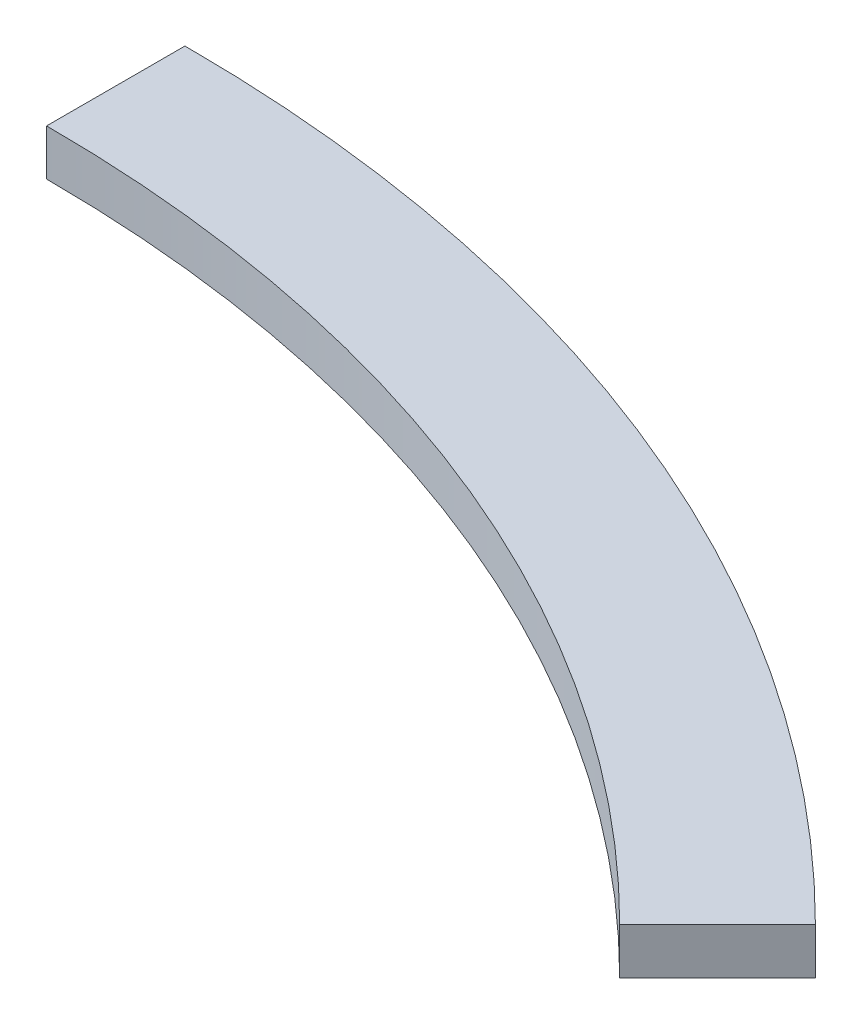
ISO-10303-21;
HEADER;
FILE_DESCRIPTION(('STEP AP214'),'2;1');
FILE_NAME('part.step','',(''),(''),'','','');
FILE_SCHEMA(('AUTOMOTIVE_DESIGN { 1 0 10303 214 1 1 1 1 }'));
ENDSEC;
DATA;
#1=APPLICATION_CONTEXT('core data for automotive mechanical design processes');
#2=APPLICATION_PROTOCOL_DEFINITION('international standard','automotive_design',2000,#1);
#3=PRODUCT_CONTEXT('',#1,'mechanical');
#4=PRODUCT('Part','Part','',(#3));
#5=PRODUCT_RELATED_PRODUCT_CATEGORY('part','',(#4));
#6=PRODUCT_DEFINITION_FORMATION('','',#4);
#7=PRODUCT_DEFINITION_CONTEXT('part definition',#1,'design');
#8=PRODUCT_DEFINITION('design','',#6,#7);
#9=PRODUCT_DEFINITION_SHAPE('','',#8);
#10=(LENGTH_UNIT() NAMED_UNIT(*) SI_UNIT(.MILLI.,.METRE.));
#11=(NAMED_UNIT(*) PLANE_ANGLE_UNIT() SI_UNIT($,.RADIAN.));
#12=(NAMED_UNIT(*) SI_UNIT($,.STERADIAN.) SOLID_ANGLE_UNIT());
#13=UNCERTAINTY_MEASURE_WITH_UNIT(LENGTH_MEASURE(1.E-05),#10,'distance_accuracy_value','');
#14=(GEOMETRIC_REPRESENTATION_CONTEXT(3) GLOBAL_UNCERTAINTY_ASSIGNED_CONTEXT((#13)) GLOBAL_UNIT_ASSIGNED_CONTEXT((#10,
#11,#12)) REPRESENTATION_CONTEXT('',''));
#15=CARTESIAN_POINT('',(0.,0.,0.));
#16=DIRECTION('',(0.,0.,1.));
#17=DIRECTION('',(1.,0.,0.));
#18=AXIS2_PLACEMENT_3D('',#15,#16,#17);
#19=CARTESIAN_POINT('',(0.,10.,0.));
#20=DIRECTION('',(0.,-1.,0.));
#21=DIRECTION('',(0.,0.,-1.));
#22=AXIS2_PLACEMENT_3D('',#19,#20,#21);
#23=CYLINDRICAL_SURFACE('',#22,330.);
#24=CARTESIAN_POINT('',(0.,0.,0.));
#25=DIRECTION('',(0.,1.,0.));
#26=DIRECTION('',(0.,0.,1.));
#27=AXIS2_PLACEMENT_3D('',#24,#25,#26);
#28=CIRCLE('',#27,330.);
#29=CARTESIAN_POINT('',(0.,0.,-330.));
#30=VERTEX_POINT('',#29);
#31=CARTESIAN_POINT('',(233.345237791561,0.,-233.34523779156));
#32=VERTEX_POINT('',#31);
#33=EDGE_CURVE('E97',#30,#32,#28,.F.);
#34=ORIENTED_EDGE('',*,*,#33,.F.);
#35=DIRECTION('',(0.,-1.,0.));
#36=VECTOR('',#35,1.);
#37=CARTESIAN_POINT('',(0.,10.,-330.));
#38=LINE('',#37,#36);
#39=CARTESIAN_POINT('',(0.,10.,-330.));
#40=VERTEX_POINT('',#39);
#41=EDGE_CURVE('E11',#40,#30,#38,.T.);
#42=ORIENTED_EDGE('',*,*,#41,.F.);
#43=CARTESIAN_POINT('',(0.,10.,0.));
#44=DIRECTION('',(0.,1.,0.));
#45=DIRECTION('',(0.,0.,1.));
#46=AXIS2_PLACEMENT_3D('',#43,#44,#45);
#47=CIRCLE('',#46,330.);
#48=CARTESIAN_POINT('',(233.345237791561,10.,-233.34523779156));
#49=VERTEX_POINT('',#48);
#50=EDGE_CURVE('E91',#40,#49,#47,.F.);
#51=ORIENTED_EDGE('',*,*,#50,.T.);
#52=DIRECTION('',(0.,-1.,0.));
#53=VECTOR('',#52,1.);
#54=CARTESIAN_POINT('',(233.345237791561,10.,-233.34523779156));
#55=LINE('',#54,#53);
#56=EDGE_CURVE('E72',#49,#32,#55,.T.);
#57=ORIENTED_EDGE('',*,*,#56,.T.);
#58=EDGE_LOOP('',(#34,#42,#51,#57));
#59=FACE_BOUND('',#58,.T.);
#60=ADVANCED_FACE('F34',(#59),#23,.T.);
#61=CARTESIAN_POINT('',(0.,10.,0.));
#62=DIRECTION('',(-1.,0.,0.));
#63=DIRECTION('',(0.,0.,1.));
#64=AXIS2_PLACEMENT_3D('',#61,#62,#63);
#65=PLANE('',#64);
#66=DIRECTION('',(0.,0.,-1.));
#67=VECTOR('',#66,1.);
#68=CARTESIAN_POINT('',(0.,0.,0.));
#69=LINE('',#68,#67);
#70=CARTESIAN_POINT('',(0.,0.,-300.));
#71=VERTEX_POINT('',#70);
#72=EDGE_CURVE('E85',#71,#30,#69,.T.);
#73=ORIENTED_EDGE('',*,*,#72,.F.);
#74=DIRECTION('',(0.,-1.,0.));
#75=VECTOR('',#74,1.);
#76=CARTESIAN_POINT('',(0.,10.,-300.));
#77=LINE('',#76,#75);
#78=CARTESIAN_POINT('',(0.,10.,-300.));
#79=VERTEX_POINT('',#78);
#80=EDGE_CURVE('E42',#79,#71,#77,.T.);
#81=ORIENTED_EDGE('',*,*,#80,.F.);
#82=DIRECTION('',(0.,0.,-1.));
#83=VECTOR('',#82,1.);
#84=CARTESIAN_POINT('',(0.,10.,0.));
#85=LINE('',#84,#83);
#86=EDGE_CURVE('E83',#79,#40,#85,.T.);
#87=ORIENTED_EDGE('',*,*,#86,.T.);
#88=ORIENTED_EDGE('',*,*,#41,.T.);
#89=EDGE_LOOP('',(#73,#81,#87,#88));
#90=FACE_BOUND('',#89,.T.);
#91=ADVANCED_FACE('F81',(#90),#65,.T.);
#92=CARTESIAN_POINT('',(0.,10.,0.));
#93=DIRECTION('',(0.,-1.,0.));
#94=DIRECTION('',(0.,0.,-1.));
#95=AXIS2_PLACEMENT_3D('',#92,#93,#94);
#96=CYLINDRICAL_SURFACE('',#95,300.);
#97=CARTESIAN_POINT('',(0.,0.,0.));
#98=DIRECTION('',(0.,1.,0.));
#99=DIRECTION('',(0.,0.,1.));
#100=AXIS2_PLACEMENT_3D('',#97,#98,#99);
#101=CIRCLE('',#100,300.);
#102=CARTESIAN_POINT('',(212.132034355965,0.,-212.132034355964));
#103=VERTEX_POINT('',#102);
#104=EDGE_CURVE('E65',#71,#103,#101,.F.);
#105=ORIENTED_EDGE('',*,*,#104,.T.);
#106=DIRECTION('',(0.,-1.,0.));
#107=VECTOR('',#106,1.);
#108=CARTESIAN_POINT('',(212.132034355965,10.,-212.132034355964));
#109=LINE('',#108,#107);
#110=CARTESIAN_POINT('',(212.132034355965,10.,-212.132034355964));
#111=VERTEX_POINT('',#110);
#112=EDGE_CURVE('E86',#111,#103,#109,.T.);
#113=ORIENTED_EDGE('',*,*,#112,.F.);
#114=CARTESIAN_POINT('',(0.,10.,0.));
#115=DIRECTION('',(0.,1.,0.));
#116=DIRECTION('',(0.,0.,1.));
#117=AXIS2_PLACEMENT_3D('',#114,#115,#116);
#118=CIRCLE('',#117,300.);
#119=EDGE_CURVE('E87',#79,#111,#118,.F.);
#120=ORIENTED_EDGE('',*,*,#119,.F.);
#121=ORIENTED_EDGE('',*,*,#80,.T.);
#122=EDGE_LOOP('',(#105,#113,#120,#121));
#123=FACE_BOUND('',#122,.T.);
#124=ADVANCED_FACE('F88',(#123),#96,.F.);
#125=CARTESIAN_POINT('',(0.,10.,0.));
#126=DIRECTION('',(-0.707106781186546,0.,-0.707106781186549));
#127=DIRECTION('',(-0.707106781186549,0.,0.707106781186546));
#128=AXIS2_PLACEMENT_3D('',#125,#126,#127);
#129=PLANE('',#128);
#130=DIRECTION('',(0.707106781186549,0.,-0.707106781186546));
#131=VECTOR('',#130,1.);
#132=CARTESIAN_POINT('',(0.,0.,0.));
#133=LINE('',#132,#131);
#134=EDGE_CURVE('E93',#103,#32,#133,.T.);
#135=ORIENTED_EDGE('',*,*,#134,.T.);
#136=ORIENTED_EDGE('',*,*,#56,.F.);
#137=DIRECTION('',(0.707106781186549,0.,-0.707106781186546));
#138=VECTOR('',#137,1.);
#139=CARTESIAN_POINT('',(0.,10.,0.));
#140=LINE('',#139,#138);
#141=EDGE_CURVE('E50',#111,#49,#140,.T.);
#142=ORIENTED_EDGE('',*,*,#141,.F.);
#143=ORIENTED_EDGE('',*,*,#112,.T.);
#144=EDGE_LOOP('',(#135,#136,#142,#143));
#145=FACE_BOUND('',#144,.T.);
#146=ADVANCED_FACE('F106',(#145),#129,.F.);
#147=CARTESIAN_POINT('',(0.,10.,0.));
#148=DIRECTION('',(0.,1.,0.));
#149=DIRECTION('',(0.,0.,1.));
#150=AXIS2_PLACEMENT_3D('',#147,#148,#149);
#151=PLANE('',#150);
#152=ORIENTED_EDGE('',*,*,#50,.F.);
#153=ORIENTED_EDGE('',*,*,#86,.F.);
#154=ORIENTED_EDGE('',*,*,#119,.T.);
#155=ORIENTED_EDGE('',*,*,#141,.T.);
#156=EDGE_LOOP('',(#152,#153,#154,#155));
#157=FACE_BOUND('',#156,.T.);
#158=ADVANCED_FACE('F90',(#157),#151,.T.);
#159=CARTESIAN_POINT('',(0.,0.,0.));
#160=DIRECTION('',(0.,1.,0.));
#161=DIRECTION('',(0.,0.,1.));
#162=AXIS2_PLACEMENT_3D('',#159,#160,#161);
#163=PLANE('',#162);
#164=ORIENTED_EDGE('',*,*,#33,.T.);
#165=ORIENTED_EDGE('',*,*,#134,.F.);
#166=ORIENTED_EDGE('',*,*,#104,.F.);
#167=ORIENTED_EDGE('',*,*,#72,.T.);
#168=EDGE_LOOP('',(#164,#165,#166,#167));
#169=FACE_BOUND('',#168,.T.);
#170=ADVANCED_FACE('F108',(#169),#163,.F.);
#171=CLOSED_SHELL('',(#60,#91,#124,#146,#158,#170));
#172=MANIFOLD_SOLID_BREP('B2',#171);
#173=ADVANCED_BREP_SHAPE_REPRESENTATION('',(#18,#172),#14);
#174=SHAPE_DEFINITION_REPRESENTATION(#9,#173);
ENDSEC;
END-ISO-10303-21;
